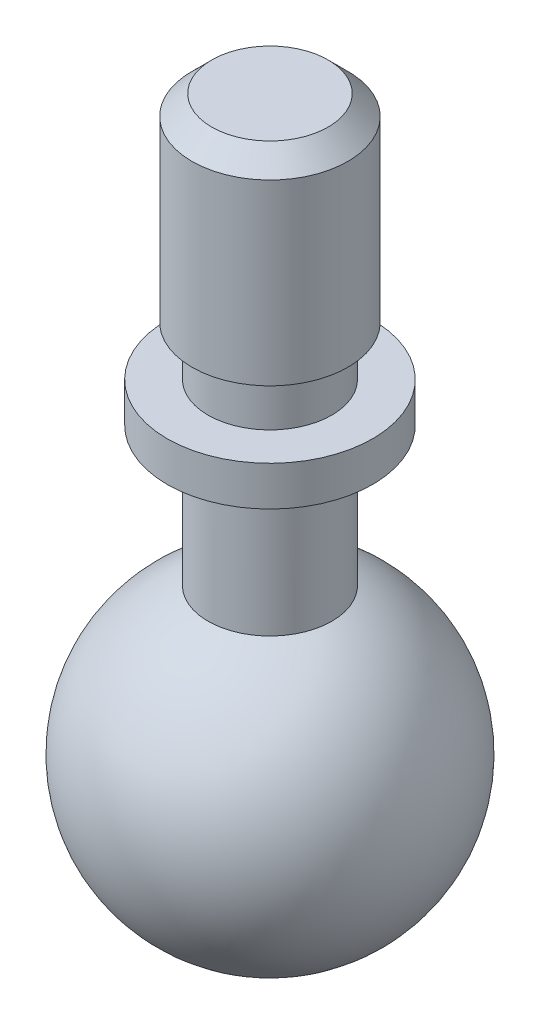
ISO-10303-21;
HEADER;
FILE_DESCRIPTION(('STEP AP214'),'2;1');
FILE_NAME('part.step','',(''),(''),'','','');
FILE_SCHEMA(('AUTOMOTIVE_DESIGN { 1 0 10303 214 1 1 1 1 }'));
ENDSEC;
DATA;
#1=APPLICATION_CONTEXT('core data for automotive mechanical design processes');
#2=APPLICATION_PROTOCOL_DEFINITION('international standard','automotive_design',2000,#1);
#3=PRODUCT_CONTEXT('',#1,'mechanical');
#4=PRODUCT('Part','Part','',(#3));
#5=PRODUCT_RELATED_PRODUCT_CATEGORY('part','',(#4));
#6=PRODUCT_DEFINITION_FORMATION('','',#4);
#7=PRODUCT_DEFINITION_CONTEXT('part definition',#1,'design');
#8=PRODUCT_DEFINITION('design','',#6,#7);
#9=PRODUCT_DEFINITION_SHAPE('','',#8);
#10=(LENGTH_UNIT() NAMED_UNIT(*) SI_UNIT(.MILLI.,.METRE.));
#11=(NAMED_UNIT(*) PLANE_ANGLE_UNIT() SI_UNIT($,.RADIAN.));
#12=(NAMED_UNIT(*) SI_UNIT($,.STERADIAN.) SOLID_ANGLE_UNIT());
#13=UNCERTAINTY_MEASURE_WITH_UNIT(LENGTH_MEASURE(1.E-05),#10,'distance_accuracy_value','');
#14=(GEOMETRIC_REPRESENTATION_CONTEXT(3) GLOBAL_UNCERTAINTY_ASSIGNED_CONTEXT((#13)) GLOBAL_UNIT_ASSIGNED_CONTEXT((#10,
#11,#12)) REPRESENTATION_CONTEXT('',''));
#15=CARTESIAN_POINT('',(0.,0.,0.));
#16=DIRECTION('',(0.,0.,1.));
#17=DIRECTION('',(1.,0.,0.));
#18=AXIS2_PLACEMENT_3D('',#15,#16,#17);
#19=CARTESIAN_POINT('',(0.,13.1,0.));
#20=DIRECTION('',(0.,1.,0.));
#21=DIRECTION('',(0.,0.,1.));
#22=AXIS2_PLACEMENT_3D('',#19,#20,#21);
#23=PLANE('',#22);
#24=CARTESIAN_POINT('',(0.,13.1,0.));
#25=DIRECTION('',(0.,1.,0.));
#26=DIRECTION('',(0.,0.,1.));
#27=AXIS2_PLACEMENT_3D('',#24,#25,#26);
#28=CIRCLE('',#27,4.15);
#29=CARTESIAN_POINT('',(0.,13.1,4.15));
#30=VERTEX_POINT('',#29);
#31=EDGE_CURVE('E35',#30,#30,#28,.T.);
#32=ORIENTED_EDGE('',*,*,#31,.T.);
#33=EDGE_LOOP('',(#32));
#34=FACE_BOUND('',#33,.T.);
#35=CARTESIAN_POINT('',(0.,13.1,0.));
#36=DIRECTION('',(0.,1.,0.));
#37=DIRECTION('',(0.,0.,1.));
#38=AXIS2_PLACEMENT_3D('',#35,#36,#37);
#39=CIRCLE('',#38,2.5);
#40=CARTESIAN_POINT('',(0.,13.1,2.5));
#41=VERTEX_POINT('',#40);
#42=EDGE_CURVE('E41',#41,#41,#39,.T.);
#43=ORIENTED_EDGE('',*,*,#42,.F.);
#44=EDGE_LOOP('',(#43));
#45=FACE_BOUND('',#44,.T.);
#46=ADVANCED_FACE('F15',(#34,#45),#23,.T.);
#47=CARTESIAN_POINT('',(0.,0.,0.));
#48=DIRECTION('',(0.,-1.,0.));
#49=DIRECTION('',(1.,0.,0.));
#50=AXIS2_PLACEMENT_3D('',#47,#48,#49);
#51=SPHERICAL_SURFACE('',#50,6.4);
#52=CARTESIAN_POINT('',(0.,5.89151932866217,0.));
#53=DIRECTION('',(0.,-1.,0.));
#54=DIRECTION('',(0.,0.,-1.));
#55=AXIS2_PLACEMENT_3D('',#52,#53,#54);
#56=CIRCLE('',#55,2.5);
#57=CARTESIAN_POINT('',(0.,5.89151932866217,-2.5));
#58=VERTEX_POINT('',#57);
#59=EDGE_CURVE('E27',#58,#58,#56,.F.);
#60=ORIENTED_EDGE('',*,*,#59,.F.);
#61=EDGE_LOOP('',(#60));
#62=FACE_BOUND('',#61,.T.);
#63=ADVANCED_FACE('F71',(#62),#51,.T.);
#64=CARTESIAN_POINT('',(0.,11.5,0.));
#65=DIRECTION('',(0.,-1.,0.));
#66=DIRECTION('',(0.,0.,-1.));
#67=AXIS2_PLACEMENT_3D('',#64,#65,#66);
#68=CYLINDRICAL_SURFACE('',#67,2.5);
#69=CARTESIAN_POINT('',(0.,11.5,0.));
#70=DIRECTION('',(0.,1.,0.));
#71=DIRECTION('',(0.,0.,1.));
#72=AXIS2_PLACEMENT_3D('',#69,#70,#71);
#73=CIRCLE('',#72,2.5);
#74=CARTESIAN_POINT('',(0.,11.5,2.5));
#75=VERTEX_POINT('',#74);
#76=EDGE_CURVE('E32',#75,#75,#73,.T.);
#77=ORIENTED_EDGE('',*,*,#76,.F.);
#78=EDGE_LOOP('',(#77));
#79=FACE_BOUND('',#78,.T.);
#80=ORIENTED_EDGE('',*,*,#59,.T.);
#81=EDGE_LOOP('',(#80));
#82=FACE_BOUND('',#81,.T.);
#83=ADVANCED_FACE('F77',(#79,#82),#68,.T.);
#84=CARTESIAN_POINT('',(0.,11.5,0.));
#85=DIRECTION('',(0.,1.,0.));
#86=DIRECTION('',(0.,0.,1.));
#87=AXIS2_PLACEMENT_3D('',#84,#85,#86);
#88=PLANE('',#87);
#89=CARTESIAN_POINT('',(0.,11.5,0.));
#90=DIRECTION('',(0.,1.,0.));
#91=DIRECTION('',(0.,0.,1.));
#92=AXIS2_PLACEMENT_3D('',#89,#90,#91);
#93=CIRCLE('',#92,4.15);
#94=CARTESIAN_POINT('',(0.,11.5,4.15));
#95=VERTEX_POINT('',#94);
#96=EDGE_CURVE('E36',#95,#95,#93,.T.);
#97=ORIENTED_EDGE('',*,*,#96,.F.);
#98=EDGE_LOOP('',(#97));
#99=FACE_BOUND('',#98,.T.);
#100=ORIENTED_EDGE('',*,*,#76,.T.);
#101=EDGE_LOOP('',(#100));
#102=FACE_BOUND('',#101,.T.);
#103=ADVANCED_FACE('F66',(#99,#102),#88,.F.);
#104=CARTESIAN_POINT('',(0.,13.1,0.));
#105=DIRECTION('',(0.,-1.,0.));
#106=DIRECTION('',(0.,0.,-1.));
#107=AXIS2_PLACEMENT_3D('',#104,#105,#106);
#108=CYLINDRICAL_SURFACE('',#107,4.15);
#109=ORIENTED_EDGE('',*,*,#31,.F.);
#110=EDGE_LOOP('',(#109));
#111=FACE_BOUND('',#110,.T.);
#112=ORIENTED_EDGE('',*,*,#96,.T.);
#113=EDGE_LOOP('',(#112));
#114=FACE_BOUND('',#113,.T.);
#115=ADVANCED_FACE('F56',(#111,#114),#108,.T.);
#116=CARTESIAN_POINT('',(0.,15.1,0.));
#117=DIRECTION('',(0.,1.,0.));
#118=DIRECTION('',(0.,0.,1.));
#119=AXIS2_PLACEMENT_3D('',#116,#117,#118);
#120=PLANE('',#119);
#121=CARTESIAN_POINT('',(0.,15.1,0.));
#122=DIRECTION('',(0.,1.,0.));
#123=DIRECTION('',(0.,0.,1.));
#124=AXIS2_PLACEMENT_3D('',#121,#122,#123);
#125=CIRCLE('',#124,2.5);
#126=CARTESIAN_POINT('',(0.,15.1,2.5));
#127=VERTEX_POINT('',#126);
#128=EDGE_CURVE('E44',#127,#127,#125,.T.);
#129=ORIENTED_EDGE('',*,*,#128,.T.);
#130=EDGE_LOOP('',(#129));
#131=FACE_BOUND('',#130,.T.);
#132=CARTESIAN_POINT('',(0.,15.1,0.));
#133=DIRECTION('',(0.,1.,0.));
#134=DIRECTION('',(0.,0.,1.));
#135=AXIS2_PLACEMENT_3D('',#132,#133,#134);
#136=CIRCLE('',#135,3.15);
#137=CARTESIAN_POINT('',(0.,15.1,3.15));
#138=VERTEX_POINT('',#137);
#139=EDGE_CURVE('E19',#138,#138,#136,.T.);
#140=ORIENTED_EDGE('',*,*,#139,.F.);
#141=EDGE_LOOP('',(#140));
#142=FACE_BOUND('',#141,.T.);
#143=ADVANCED_FACE('F53',(#131,#142),#120,.F.);
#144=CARTESIAN_POINT('',(0.,15.1,0.));
#145=DIRECTION('',(0.,-1.,0.));
#146=DIRECTION('',(0.,0.,-1.));
#147=AXIS2_PLACEMENT_3D('',#144,#145,#146);
#148=CYLINDRICAL_SURFACE('',#147,2.5);
#149=ORIENTED_EDGE('',*,*,#128,.F.);
#150=EDGE_LOOP('',(#149));
#151=FACE_BOUND('',#150,.T.);
#152=ORIENTED_EDGE('',*,*,#42,.T.);
#153=EDGE_LOOP('',(#152));
#154=FACE_BOUND('',#153,.T.);
#155=ADVANCED_FACE('F55',(#151,#154),#148,.T.);
#156=CARTESIAN_POINT('',(0.,23.1,0.));
#157=DIRECTION('',(0.,1.,0.));
#158=DIRECTION('',(0.,0.,1.));
#159=AXIS2_PLACEMENT_3D('',#156,#157,#158);
#160=PLANE('',#159);
#161=CARTESIAN_POINT('',(0.,23.1,0.));
#162=DIRECTION('',(0.,1.,0.));
#163=DIRECTION('',(0.,0.,1.));
#164=AXIS2_PLACEMENT_3D('',#161,#162,#163);
#165=CIRCLE('',#164,2.35);
#166=CARTESIAN_POINT('',(0.,23.1,2.35));
#167=VERTEX_POINT('',#166);
#168=EDGE_CURVE('E23',#167,#167,#165,.T.);
#169=ORIENTED_EDGE('',*,*,#168,.T.);
#170=EDGE_LOOP('',(#169));
#171=FACE_BOUND('',#170,.T.);
#172=ADVANCED_FACE('F63',(#171),#160,.T.);
#173=CARTESIAN_POINT('',(0.,23.1,0.));
#174=DIRECTION('',(0.,-1.,0.));
#175=DIRECTION('',(0.,0.,-1.));
#176=AXIS2_PLACEMENT_3D('',#173,#174,#175);
#177=CONICAL_SURFACE('',#176,2.35,0.785398163397446);
#178=CARTESIAN_POINT('',(0.,22.3,0.));
#179=DIRECTION('',(0.,1.,0.));
#180=DIRECTION('',(0.,0.,1.));
#181=AXIS2_PLACEMENT_3D('',#178,#179,#180);
#182=CIRCLE('',#181,3.15);
#183=CARTESIAN_POINT('',(0.,22.3,3.15));
#184=VERTEX_POINT('',#183);
#185=EDGE_CURVE('E10',#184,#184,#182,.F.);
#186=ORIENTED_EDGE('',*,*,#185,.F.);
#187=EDGE_LOOP('',(#186));
#188=FACE_BOUND('',#187,.T.);
#189=ORIENTED_EDGE('',*,*,#168,.F.);
#190=EDGE_LOOP('',(#189));
#191=FACE_BOUND('',#190,.T.);
#192=ADVANCED_FACE('F17',(#188,#191),#177,.T.);
#193=CARTESIAN_POINT('',(0.,23.1,0.));
#194=DIRECTION('',(0.,-1.,0.));
#195=DIRECTION('',(0.,0.,-1.));
#196=AXIS2_PLACEMENT_3D('',#193,#194,#195);
#197=CYLINDRICAL_SURFACE('',#196,3.15);
#198=ORIENTED_EDGE('',*,*,#139,.T.);
#199=EDGE_LOOP('',(#198));
#200=FACE_BOUND('',#199,.T.);
#201=ORIENTED_EDGE('',*,*,#185,.T.);
#202=EDGE_LOOP('',(#201));
#203=FACE_BOUND('',#202,.T.);
#204=ADVANCED_FACE('F51',(#200,#203),#197,.T.);
#205=CLOSED_SHELL('',(#46,#63,#83,#103,#115,#143,#155,#172,#192,#204));
#206=MANIFOLD_SOLID_BREP('B1',#205);
#207=ADVANCED_BREP_SHAPE_REPRESENTATION('',(#18,#206),#14);
#208=SHAPE_DEFINITION_REPRESENTATION(#9,#207);
ENDSEC;
END-ISO-10303-21;
